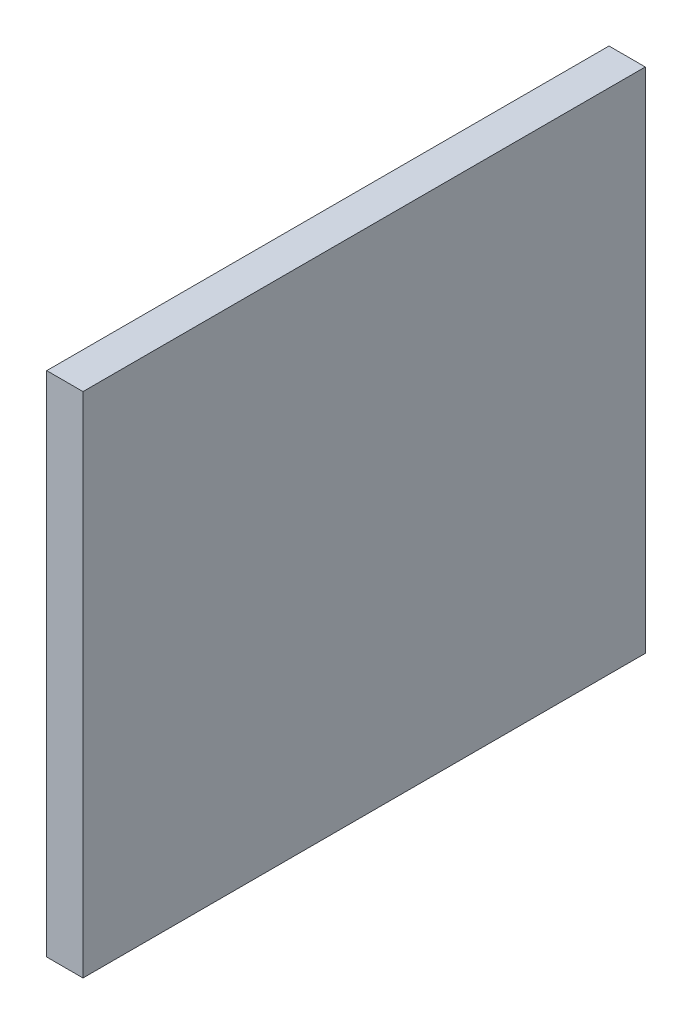
ISO-10303-21;
HEADER;
FILE_DESCRIPTION(('STEP AP214'),'2;1');
FILE_NAME('part.step','',(''),(''),'','','');
FILE_SCHEMA(('AUTOMOTIVE_DESIGN { 1 0 10303 214 1 1 1 1 }'));
ENDSEC;
DATA;
#1=APPLICATION_CONTEXT('core data for automotive mechanical design processes');
#2=APPLICATION_PROTOCOL_DEFINITION('international standard','automotive_design',2000,#1);
#3=PRODUCT_CONTEXT('',#1,'mechanical');
#4=PRODUCT('Part','Part','',(#3));
#5=PRODUCT_RELATED_PRODUCT_CATEGORY('part','',(#4));
#6=PRODUCT_DEFINITION_FORMATION('','',#4);
#7=PRODUCT_DEFINITION_CONTEXT('part definition',#1,'design');
#8=PRODUCT_DEFINITION('design','',#6,#7);
#9=PRODUCT_DEFINITION_SHAPE('','',#8);
#10=(LENGTH_UNIT() NAMED_UNIT(*) SI_UNIT(.MILLI.,.METRE.));
#11=(NAMED_UNIT(*) PLANE_ANGLE_UNIT() SI_UNIT($,.RADIAN.));
#12=(NAMED_UNIT(*) SI_UNIT($,.STERADIAN.) SOLID_ANGLE_UNIT());
#13=UNCERTAINTY_MEASURE_WITH_UNIT(LENGTH_MEASURE(1.E-05),#10,'distance_accuracy_value','');
#14=(GEOMETRIC_REPRESENTATION_CONTEXT(3) GLOBAL_UNCERTAINTY_ASSIGNED_CONTEXT((#13)) GLOBAL_UNIT_ASSIGNED_CONTEXT((#10,
#11,#12)) REPRESENTATION_CONTEXT('',''));
#15=CARTESIAN_POINT('',(0.,0.,0.));
#16=DIRECTION('',(0.,0.,1.));
#17=DIRECTION('',(1.,0.,0.));
#18=AXIS2_PLACEMENT_3D('',#15,#16,#17);
#19=CARTESIAN_POINT('',(150.,-140.,155.));
#20=DIRECTION('',(0.,1.,0.));
#21=DIRECTION('',(0.,0.,1.));
#22=AXIS2_PLACEMENT_3D('',#19,#20,#21);
#23=PLANE('',#22);
#24=DIRECTION('',(1.,0.,0.));
#25=VECTOR('',#24,1.);
#26=CARTESIAN_POINT('',(150.,-140.,0.));
#27=LINE('',#26,#25);
#28=CARTESIAN_POINT('',(150.,-140.,0.));
#29=VERTEX_POINT('',#28);
#30=CARTESIAN_POINT('',(160.,-140.,0.));
#31=VERTEX_POINT('',#30);
#32=EDGE_CURVE('E97',#29,#31,#27,.T.);
#33=ORIENTED_EDGE('',*,*,#32,.T.);
#34=DIRECTION('',(0.,0.,-1.));
#35=VECTOR('',#34,1.);
#36=CARTESIAN_POINT('',(160.,-140.,155.));
#37=LINE('',#36,#35);
#38=CARTESIAN_POINT('',(160.,-140.,155.));
#39=VERTEX_POINT('',#38);
#40=EDGE_CURVE('E11',#39,#31,#37,.T.);
#41=ORIENTED_EDGE('',*,*,#40,.F.);
#42=DIRECTION('',(1.,0.,0.));
#43=VECTOR('',#42,1.);
#44=CARTESIAN_POINT('',(150.,-140.,155.));
#45=LINE('',#44,#43);
#46=CARTESIAN_POINT('',(150.,-140.,155.));
#47=VERTEX_POINT('',#46);
#48=EDGE_CURVE('E85',#47,#39,#45,.T.);
#49=ORIENTED_EDGE('',*,*,#48,.F.);
#50=DIRECTION('',(0.,0.,-1.));
#51=VECTOR('',#50,1.);
#52=CARTESIAN_POINT('',(150.,-140.,155.));
#53=LINE('',#52,#51);
#54=EDGE_CURVE('E93',#47,#29,#53,.T.);
#55=ORIENTED_EDGE('',*,*,#54,.T.);
#56=EDGE_LOOP('',(#33,#41,#49,#55));
#57=FACE_BOUND('',#56,.T.);
#58=ADVANCED_FACE('F34',(#57),#23,.F.);
#59=CARTESIAN_POINT('',(160.,0.,155.));
#60=DIRECTION('',(-1.,0.,0.));
#61=DIRECTION('',(0.,-1.,0.));
#62=AXIS2_PLACEMENT_3D('',#59,#60,#61);
#63=PLANE('',#62);
#64=DIRECTION('',(0.,1.,0.));
#65=VECTOR('',#64,1.);
#66=CARTESIAN_POINT('',(160.,0.,0.));
#67=LINE('',#66,#65);
#68=CARTESIAN_POINT('',(160.,0.,0.));
#69=VERTEX_POINT('',#68);
#70=EDGE_CURVE('E89',#31,#69,#67,.T.);
#71=ORIENTED_EDGE('',*,*,#70,.T.);
#72=DIRECTION('',(0.,0.,-1.));
#73=VECTOR('',#72,1.);
#74=CARTESIAN_POINT('',(160.,0.,155.));
#75=LINE('',#74,#73);
#76=CARTESIAN_POINT('',(160.,0.,155.));
#77=VERTEX_POINT('',#76);
#78=EDGE_CURVE('E42',#77,#69,#75,.T.);
#79=ORIENTED_EDGE('',*,*,#78,.F.);
#80=DIRECTION('',(0.,1.,0.));
#81=VECTOR('',#80,1.);
#82=CARTESIAN_POINT('',(160.,0.,155.));
#83=LINE('',#82,#81);
#84=EDGE_CURVE('E80',#39,#77,#83,.T.);
#85=ORIENTED_EDGE('',*,*,#84,.F.);
#86=ORIENTED_EDGE('',*,*,#40,.T.);
#87=EDGE_LOOP('',(#71,#79,#85,#86));
#88=FACE_BOUND('',#87,.T.);
#89=ADVANCED_FACE('F88',(#88),#63,.F.);
#90=CARTESIAN_POINT('',(150.,0.,155.));
#91=DIRECTION('',(0.,-1.,0.));
#92=DIRECTION('',(0.,0.,-1.));
#93=AXIS2_PLACEMENT_3D('',#90,#91,#92);
#94=PLANE('',#93);
#95=DIRECTION('',(-1.,0.,0.));
#96=VECTOR('',#95,1.);
#97=CARTESIAN_POINT('',(150.,0.,0.));
#98=LINE('',#97,#96);
#99=CARTESIAN_POINT('',(150.,0.,0.));
#100=VERTEX_POINT('',#99);
#101=EDGE_CURVE('E67',#69,#100,#98,.T.);
#102=ORIENTED_EDGE('',*,*,#101,.T.);
#103=DIRECTION('',(0.,0.,-1.));
#104=VECTOR('',#103,1.);
#105=CARTESIAN_POINT('',(150.,0.,155.));
#106=LINE('',#105,#104);
#107=CARTESIAN_POINT('',(150.,0.,155.));
#108=VERTEX_POINT('',#107);
#109=EDGE_CURVE('E90',#108,#100,#106,.T.);
#110=ORIENTED_EDGE('',*,*,#109,.F.);
#111=DIRECTION('',(-1.,0.,0.));
#112=VECTOR('',#111,1.);
#113=CARTESIAN_POINT('',(150.,0.,155.));
#114=LINE('',#113,#112);
#115=EDGE_CURVE('E83',#77,#108,#114,.T.);
#116=ORIENTED_EDGE('',*,*,#115,.F.);
#117=ORIENTED_EDGE('',*,*,#78,.T.);
#118=EDGE_LOOP('',(#102,#110,#116,#117));
#119=FACE_BOUND('',#118,.T.);
#120=ADVANCED_FACE('F91',(#119),#94,.F.);
#121=CARTESIAN_POINT('',(150.,-140.,155.));
#122=DIRECTION('',(1.,0.,0.));
#123=DIRECTION('',(0.,1.,0.));
#124=AXIS2_PLACEMENT_3D('',#121,#122,#123);
#125=PLANE('',#124);
#126=DIRECTION('',(0.,-1.,0.));
#127=VECTOR('',#126,1.);
#128=CARTESIAN_POINT('',(150.,-140.,0.));
#129=LINE('',#128,#127);
#130=EDGE_CURVE('E73',#100,#29,#129,.T.);
#131=ORIENTED_EDGE('',*,*,#130,.T.);
#132=ORIENTED_EDGE('',*,*,#54,.F.);
#133=DIRECTION('',(0.,-1.,0.));
#134=VECTOR('',#133,1.);
#135=CARTESIAN_POINT('',(150.,-140.,155.));
#136=LINE('',#135,#134);
#137=EDGE_CURVE('E50',#108,#47,#136,.T.);
#138=ORIENTED_EDGE('',*,*,#137,.F.);
#139=ORIENTED_EDGE('',*,*,#109,.T.);
#140=EDGE_LOOP('',(#131,#132,#138,#139));
#141=FACE_BOUND('',#140,.T.);
#142=ADVANCED_FACE('F104',(#141),#125,.F.);
#143=CARTESIAN_POINT('',(0.,0.,155.));
#144=DIRECTION('',(0.,0.,-1.));
#145=DIRECTION('',(-1.,0.,0.));
#146=AXIS2_PLACEMENT_3D('',#143,#144,#145);
#147=PLANE('',#146);
#148=ORIENTED_EDGE('',*,*,#48,.T.);
#149=ORIENTED_EDGE('',*,*,#84,.T.);
#150=ORIENTED_EDGE('',*,*,#115,.T.);
#151=ORIENTED_EDGE('',*,*,#137,.T.);
#152=EDGE_LOOP('',(#148,#149,#150,#151));
#153=FACE_BOUND('',#152,.T.);
#154=ADVANCED_FACE('F81',(#153),#147,.F.);
#155=CARTESIAN_POINT('',(0.,0.,0.));
#156=DIRECTION('',(0.,0.,-1.));
#157=DIRECTION('',(-1.,0.,0.));
#158=AXIS2_PLACEMENT_3D('',#155,#156,#157);
#159=PLANE('',#158);
#160=ORIENTED_EDGE('',*,*,#32,.F.);
#161=ORIENTED_EDGE('',*,*,#130,.F.);
#162=ORIENTED_EDGE('',*,*,#101,.F.);
#163=ORIENTED_EDGE('',*,*,#70,.F.);
#164=EDGE_LOOP('',(#160,#161,#162,#163));
#165=FACE_BOUND('',#164,.T.);
#166=ADVANCED_FACE('F107',(#165),#159,.T.);
#167=CLOSED_SHELL('',(#58,#89,#120,#142,#154,#166));
#168=MANIFOLD_SOLID_BREP('B2',#167);
#169=ADVANCED_BREP_SHAPE_REPRESENTATION('',(#18,#168),#14);
#170=SHAPE_DEFINITION_REPRESENTATION(#9,#169);
ENDSEC;
END-ISO-10303-21;
